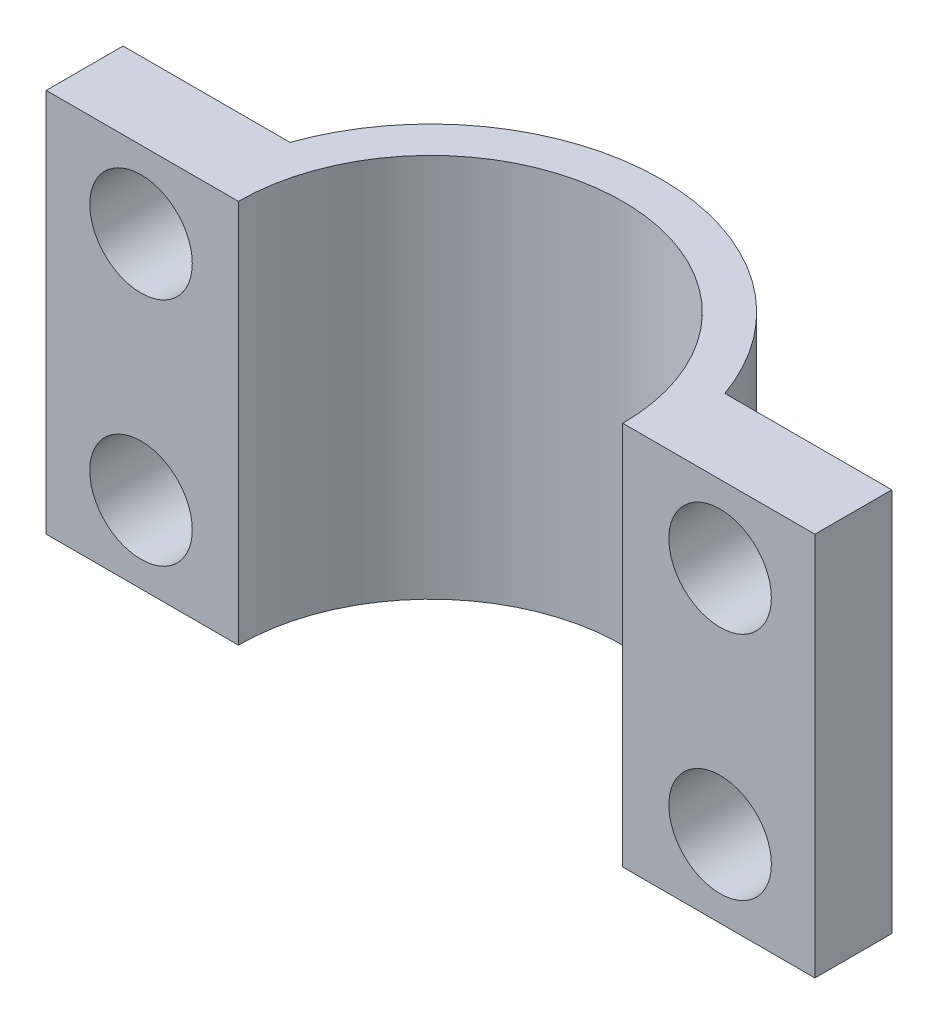
ISO-10303-21;
HEADER;
FILE_DESCRIPTION(('STEP AP214'),'2;1');
FILE_NAME('part.step','',(''),(''),'','','');
FILE_SCHEMA(('AUTOMOTIVE_DESIGN { 1 0 10303 214 1 1 1 1 }'));
ENDSEC;
DATA;
#1=APPLICATION_CONTEXT('core data for automotive mechanical design processes');
#2=APPLICATION_PROTOCOL_DEFINITION('international standard','automotive_design',2000,#1);
#3=PRODUCT_CONTEXT('',#1,'mechanical');
#4=PRODUCT('Part','Part','',(#3));
#5=PRODUCT_RELATED_PRODUCT_CATEGORY('part','',(#4));
#6=PRODUCT_DEFINITION_FORMATION('','',#4);
#7=PRODUCT_DEFINITION_CONTEXT('part definition',#1,'design');
#8=PRODUCT_DEFINITION('design','',#6,#7);
#9=PRODUCT_DEFINITION_SHAPE('','',#8);
#10=(LENGTH_UNIT() NAMED_UNIT(*) SI_UNIT(.MILLI.,.METRE.));
#11=(NAMED_UNIT(*) PLANE_ANGLE_UNIT() SI_UNIT($,.RADIAN.));
#12=(NAMED_UNIT(*) SI_UNIT($,.STERADIAN.) SOLID_ANGLE_UNIT());
#13=UNCERTAINTY_MEASURE_WITH_UNIT(LENGTH_MEASURE(1.E-05),#10,'distance_accuracy_value','');
#14=(GEOMETRIC_REPRESENTATION_CONTEXT(3) GLOBAL_UNCERTAINTY_ASSIGNED_CONTEXT((#13)) GLOBAL_UNIT_ASSIGNED_CONTEXT((#10,
#11,#12)) REPRESENTATION_CONTEXT('',''));
#15=CARTESIAN_POINT('',(0.,0.,0.));
#16=DIRECTION('',(0.,0.,1.));
#17=DIRECTION('',(1.,0.,0.));
#18=AXIS2_PLACEMENT_3D('',#15,#16,#17);
#19=CARTESIAN_POINT('',(0.,0.,15.));
#20=DIRECTION('',(0.,0.,1.));
#21=DIRECTION('',(1.,0.,0.));
#22=AXIS2_PLACEMENT_3D('',#19,#20,#21);
#23=PLANE('',#22);
#24=CARTESIAN_POINT('',(-11.3,4.5,15.));
#25=DIRECTION('',(0.,0.,1.));
#26=DIRECTION('',(1.,0.,0.));
#27=AXIS2_PLACEMENT_3D('',#24,#25,#26);
#28=CIRCLE('',#27,2.);
#29=CARTESIAN_POINT('',(-9.3,4.5,15.));
#30=VERTEX_POINT('',#29);
#31=EDGE_CURVE('E221',#30,#30,#28,.F.);
#32=ORIENTED_EDGE('',*,*,#31,.T.);
#33=EDGE_LOOP('',(#32));
#34=FACE_BOUND('',#33,.T.);
#35=CARTESIAN_POINT('',(-11.3,-4.5,15.));
#36=DIRECTION('',(0.,0.,1.));
#37=DIRECTION('',(1.,0.,0.));
#38=AXIS2_PLACEMENT_3D('',#35,#36,#37);
#39=CIRCLE('',#38,2.);
#40=CARTESIAN_POINT('',(-9.3,-4.5,15.));
#41=VERTEX_POINT('',#40);
#42=EDGE_CURVE('E197',#41,#41,#39,.F.);
#43=ORIENTED_EDGE('',*,*,#42,.T.);
#44=EDGE_LOOP('',(#43));
#45=FACE_BOUND('',#44,.T.);
#46=DIRECTION('',(0.,-1.,0.));
#47=VECTOR('',#46,1.);
#48=CARTESIAN_POINT('',(-7.5,7.5,15.));
#49=LINE('',#48,#47);
#50=CARTESIAN_POINT('',(-7.5,7.5,15.));
#51=VERTEX_POINT('',#50);
#52=CARTESIAN_POINT('',(-7.5,-7.5,15.));
#53=VERTEX_POINT('',#52);
#54=EDGE_CURVE('E11',#51,#53,#49,.T.);
#55=ORIENTED_EDGE('',*,*,#54,.F.);
#56=DIRECTION('',(-1.,0.,0.));
#57=VECTOR('',#56,1.);
#58=CARTESIAN_POINT('',(15.,7.5,15.));
#59=LINE('',#58,#57);
#60=CARTESIAN_POINT('',(-15.,7.5,15.));
#61=VERTEX_POINT('',#60);
#62=EDGE_CURVE('E152',#51,#61,#59,.T.);
#63=ORIENTED_EDGE('',*,*,#62,.T.);
#64=DIRECTION('',(0.,-1.,0.));
#65=VECTOR('',#64,1.);
#66=CARTESIAN_POINT('',(-15.,-7.5,15.));
#67=LINE('',#66,#65);
#68=CARTESIAN_POINT('',(-15.,-7.5,15.));
#69=VERTEX_POINT('',#68);
#70=EDGE_CURVE('E154',#61,#69,#67,.T.);
#71=ORIENTED_EDGE('',*,*,#70,.T.);
#72=DIRECTION('',(1.,0.,0.));
#73=VECTOR('',#72,1.);
#74=CARTESIAN_POINT('',(15.,-7.5,15.));
#75=LINE('',#74,#73);
#76=EDGE_CURVE('E163',#69,#53,#75,.T.);
#77=ORIENTED_EDGE('',*,*,#76,.T.);
#78=EDGE_LOOP('',(#55,#63,#71,#77));
#79=FACE_BOUND('',#78,.T.);
#80=ADVANCED_FACE('F39',(#34,#45,#79),#23,.T.);
#81=CARTESIAN_POINT('',(-15.,-7.5,15.));
#82=DIRECTION('',(1.,0.,0.));
#83=DIRECTION('',(0.,0.,-1.));
#84=AXIS2_PLACEMENT_3D('',#81,#82,#83);
#85=PLANE('',#84);
#86=DIRECTION('',(0.,0.,-1.));
#87=VECTOR('',#86,1.);
#88=CARTESIAN_POINT('',(-15.,7.5,15.));
#89=LINE('',#88,#87);
#90=CARTESIAN_POINT('',(-15.,7.5,12.));
#91=VERTEX_POINT('',#90);
#92=EDGE_CURVE('E132',#61,#91,#89,.T.);
#93=ORIENTED_EDGE('',*,*,#92,.T.);
#94=DIRECTION('',(0.,-1.,0.));
#95=VECTOR('',#94,1.);
#96=CARTESIAN_POINT('',(-15.,7.5,12.));
#97=LINE('',#96,#95);
#98=CARTESIAN_POINT('',(-15.,-7.5,12.));
#99=VERTEX_POINT('',#98);
#100=EDGE_CURVE('E172',#91,#99,#97,.T.);
#101=ORIENTED_EDGE('',*,*,#100,.T.);
#102=DIRECTION('',(0.,0.,-1.));
#103=VECTOR('',#102,1.);
#104=CARTESIAN_POINT('',(-15.,-7.5,15.));
#105=LINE('',#104,#103);
#106=EDGE_CURVE('E136',#69,#99,#105,.T.);
#107=ORIENTED_EDGE('',*,*,#106,.F.);
#108=ORIENTED_EDGE('',*,*,#70,.F.);
#109=EDGE_LOOP('',(#93,#101,#107,#108));
#110=FACE_BOUND('',#109,.T.);
#111=ADVANCED_FACE('F41',(#110),#85,.F.);
#112=CARTESIAN_POINT('',(15.,-7.5,15.));
#113=DIRECTION('',(0.,1.,0.));
#114=DIRECTION('',(-1.,0.,0.));
#115=AXIS2_PLACEMENT_3D('',#112,#113,#114);
#116=PLANE('',#115);
#117=ORIENTED_EDGE('',*,*,#106,.T.);
#118=DIRECTION('',(-1.,0.,0.));
#119=VECTOR('',#118,1.);
#120=CARTESIAN_POINT('',(-15.,-7.5,12.));
#121=LINE('',#120,#119);
#122=CARTESIAN_POINT('',(-8.48528137423857,-7.5,12.));
#123=VERTEX_POINT('',#122);
#124=EDGE_CURVE('E113',#123,#99,#121,.T.);
#125=ORIENTED_EDGE('',*,*,#124,.F.);
#126=CARTESIAN_POINT('',(0.,-7.5,15.));
#127=DIRECTION('',(0.,1.,0.));
#128=DIRECTION('',(1.,0.,0.));
#129=AXIS2_PLACEMENT_3D('',#126,#127,#128);
#130=CIRCLE('',#129,9.);
#131=CARTESIAN_POINT('',(8.48528137423857,-7.5,12.));
#132=VERTEX_POINT('',#131);
#133=EDGE_CURVE('E184',#132,#123,#130,.T.);
#134=ORIENTED_EDGE('',*,*,#133,.F.);
#135=DIRECTION('',(-1.,0.,0.));
#136=VECTOR('',#135,1.);
#137=CARTESIAN_POINT('',(8.48528137423857,-7.5,12.));
#138=LINE('',#137,#136);
#139=CARTESIAN_POINT('',(15.,-7.5,12.));
#140=VERTEX_POINT('',#139);
#141=EDGE_CURVE('E188',#140,#132,#138,.T.);
#142=ORIENTED_EDGE('',*,*,#141,.F.);
#143=DIRECTION('',(0.,0.,-1.));
#144=VECTOR('',#143,1.);
#145=CARTESIAN_POINT('',(15.,-7.5,15.));
#146=LINE('',#145,#144);
#147=CARTESIAN_POINT('',(15.,-7.5,15.));
#148=VERTEX_POINT('',#147);
#149=EDGE_CURVE('E123',#148,#140,#146,.T.);
#150=ORIENTED_EDGE('',*,*,#149,.F.);
#151=CARTESIAN_POINT('',(7.5,-7.5,15.));
#152=VERTEX_POINT('',#151);
#153=EDGE_CURVE('E167',#152,#148,#75,.T.);
#154=ORIENTED_EDGE('',*,*,#153,.F.);
#155=CARTESIAN_POINT('',(0.,-7.5,15.));
#156=DIRECTION('',(0.,-1.,0.));
#157=DIRECTION('',(1.,0.,0.));
#158=AXIS2_PLACEMENT_3D('',#155,#156,#157);
#159=CIRCLE('',#158,7.5);
#160=EDGE_CURVE('E62',#53,#152,#159,.T.);
#161=ORIENTED_EDGE('',*,*,#160,.F.);
#162=ORIENTED_EDGE('',*,*,#76,.F.);
#163=EDGE_LOOP('',(#117,#125,#134,#142,#150,#154,#161,#162));
#164=FACE_BOUND('',#163,.T.);
#165=ADVANCED_FACE('F245',(#164),#116,.F.);
#166=CARTESIAN_POINT('',(15.,-7.5,15.));
#167=DIRECTION('',(-1.,0.,0.));
#168=DIRECTION('',(0.,0.,1.));
#169=AXIS2_PLACEMENT_3D('',#166,#167,#168);
#170=PLANE('',#169);
#171=ORIENTED_EDGE('',*,*,#149,.T.);
#172=DIRECTION('',(0.,-1.,0.));
#173=VECTOR('',#172,1.);
#174=CARTESIAN_POINT('',(15.,7.5,12.));
#175=LINE('',#174,#173);
#176=CARTESIAN_POINT('',(15.,7.5,12.));
#177=VERTEX_POINT('',#176);
#178=EDGE_CURVE('E107',#177,#140,#175,.T.);
#179=ORIENTED_EDGE('',*,*,#178,.F.);
#180=DIRECTION('',(0.,0.,-1.));
#181=VECTOR('',#180,1.);
#182=CARTESIAN_POINT('',(15.,7.5,15.));
#183=LINE('',#182,#181);
#184=CARTESIAN_POINT('',(15.,7.5,15.));
#185=VERTEX_POINT('',#184);
#186=EDGE_CURVE('E120',#185,#177,#183,.T.);
#187=ORIENTED_EDGE('',*,*,#186,.F.);
#188=DIRECTION('',(0.,1.,0.));
#189=VECTOR('',#188,1.);
#190=CARTESIAN_POINT('',(15.,-7.5,15.));
#191=LINE('',#190,#189);
#192=EDGE_CURVE('E157',#148,#185,#191,.T.);
#193=ORIENTED_EDGE('',*,*,#192,.F.);
#194=EDGE_LOOP('',(#171,#179,#187,#193));
#195=FACE_BOUND('',#194,.T.);
#196=ADVANCED_FACE('F118',(#195),#170,.F.);
#197=CARTESIAN_POINT('',(15.,7.5,15.));
#198=DIRECTION('',(0.,-1.,0.));
#199=DIRECTION('',(1.,0.,0.));
#200=AXIS2_PLACEMENT_3D('',#197,#198,#199);
#201=PLANE('',#200);
#202=CARTESIAN_POINT('',(0.,7.5,15.));
#203=DIRECTION('',(0.,1.,0.));
#204=DIRECTION('',(1.,0.,0.));
#205=AXIS2_PLACEMENT_3D('',#202,#203,#204);
#206=CIRCLE('',#205,9.);
#207=CARTESIAN_POINT('',(8.48528137423857,7.5,12.));
#208=VERTEX_POINT('',#207);
#209=CARTESIAN_POINT('',(-8.48528137423857,7.5,12.));
#210=VERTEX_POINT('',#209);
#211=EDGE_CURVE('E55',#208,#210,#206,.T.);
#212=ORIENTED_EDGE('',*,*,#211,.T.);
#213=DIRECTION('',(-1.,0.,0.));
#214=VECTOR('',#213,1.);
#215=CARTESIAN_POINT('',(-9.,7.5,12.));
#216=LINE('',#215,#214);
#217=EDGE_CURVE('E125',#210,#91,#216,.T.);
#218=ORIENTED_EDGE('',*,*,#217,.T.);
#219=ORIENTED_EDGE('',*,*,#92,.F.);
#220=ORIENTED_EDGE('',*,*,#62,.F.);
#221=CARTESIAN_POINT('',(0.,7.5,15.));
#222=DIRECTION('',(0.,-1.,0.));
#223=DIRECTION('',(1.,0.,0.));
#224=AXIS2_PLACEMENT_3D('',#221,#222,#223);
#225=CIRCLE('',#224,7.5);
#226=CARTESIAN_POINT('',(7.5,7.5,15.));
#227=VERTEX_POINT('',#226);
#228=EDGE_CURVE('E146',#51,#227,#225,.T.);
#229=ORIENTED_EDGE('',*,*,#228,.T.);
#230=EDGE_CURVE('E130',#185,#227,#59,.T.);
#231=ORIENTED_EDGE('',*,*,#230,.F.);
#232=ORIENTED_EDGE('',*,*,#186,.T.);
#233=DIRECTION('',(-1.,0.,0.));
#234=VECTOR('',#233,1.);
#235=CARTESIAN_POINT('',(15.,7.5,12.));
#236=LINE('',#235,#234);
#237=EDGE_CURVE('E103',#177,#208,#236,.T.);
#238=ORIENTED_EDGE('',*,*,#237,.T.);
#239=EDGE_LOOP('',(#212,#218,#219,#220,#229,#231,#232,#238));
#240=FACE_BOUND('',#239,.T.);
#241=ADVANCED_FACE('F127',(#240),#201,.F.);
#242=CARTESIAN_POINT('',(11.3,-4.5,15.));
#243=DIRECTION('',(0.,0.,1.));
#244=DIRECTION('',(1.,0.,0.));
#245=AXIS2_PLACEMENT_3D('',#242,#243,#244);
#246=CIRCLE('',#245,2.);
#247=CARTESIAN_POINT('',(13.3,-4.5,15.));
#248=VERTEX_POINT('',#247);
#249=EDGE_CURVE('E205',#248,#248,#246,.F.);
#250=ORIENTED_EDGE('',*,*,#249,.T.);
#251=EDGE_LOOP('',(#250));
#252=FACE_BOUND('',#251,.T.);
#253=CARTESIAN_POINT('',(11.3,4.5,15.));
#254=DIRECTION('',(0.,0.,1.));
#255=DIRECTION('',(1.,0.,0.));
#256=AXIS2_PLACEMENT_3D('',#253,#254,#255);
#257=CIRCLE('',#256,2.);
#258=CARTESIAN_POINT('',(13.3,4.5,15.));
#259=VERTEX_POINT('',#258);
#260=EDGE_CURVE('E213',#259,#259,#257,.F.);
#261=ORIENTED_EDGE('',*,*,#260,.T.);
#262=EDGE_LOOP('',(#261));
#263=FACE_BOUND('',#262,.T.);
#264=DIRECTION('',(0.,-1.,0.));
#265=VECTOR('',#264,1.);
#266=CARTESIAN_POINT('',(7.5,7.5,15.));
#267=LINE('',#266,#265);
#268=EDGE_CURVE('E48',#152,#227,#267,.F.);
#269=ORIENTED_EDGE('',*,*,#268,.F.);
#270=ORIENTED_EDGE('',*,*,#153,.T.);
#271=ORIENTED_EDGE('',*,*,#192,.T.);
#272=ORIENTED_EDGE('',*,*,#230,.T.);
#273=EDGE_LOOP('',(#269,#270,#271,#272));
#274=FACE_BOUND('',#273,.T.);
#275=ADVANCED_FACE('F156',(#252,#263,#274),#23,.T.);
#276=CARTESIAN_POINT('',(0.,7.5,15.));
#277=DIRECTION('',(0.,-1.,0.));
#278=DIRECTION('',(1.,0.,0.));
#279=AXIS2_PLACEMENT_3D('',#276,#277,#278);
#280=CYLINDRICAL_SURFACE('',#279,7.5);
#281=ORIENTED_EDGE('',*,*,#54,.T.);
#282=ORIENTED_EDGE('',*,*,#160,.T.);
#283=ORIENTED_EDGE('',*,*,#268,.T.);
#284=ORIENTED_EDGE('',*,*,#228,.F.);
#285=EDGE_LOOP('',(#281,#282,#283,#284));
#286=FACE_BOUND('',#285,.T.);
#287=ADVANCED_FACE('F145',(#286),#280,.F.);
#288=CARTESIAN_POINT('',(-15.,7.5,12.));
#289=DIRECTION('',(0.,0.,1.));
#290=DIRECTION('',(1.,0.,0.));
#291=AXIS2_PLACEMENT_3D('',#288,#289,#290);
#292=PLANE('',#291);
#293=CARTESIAN_POINT('',(-11.3,4.5,12.));
#294=DIRECTION('',(0.,0.,-1.));
#295=DIRECTION('',(-1.,0.,0.));
#296=AXIS2_PLACEMENT_3D('',#293,#294,#295);
#297=CIRCLE('',#296,2.);
#298=CARTESIAN_POINT('',(-13.3,4.5,12.));
#299=VERTEX_POINT('',#298);
#300=EDGE_CURVE('E201',#299,#299,#297,.T.);
#301=ORIENTED_EDGE('',*,*,#300,.F.);
#302=EDGE_LOOP('',(#301));
#303=FACE_BOUND('',#302,.T.);
#304=CARTESIAN_POINT('',(-11.3,-4.5,12.));
#305=DIRECTION('',(0.,0.,-1.));
#306=DIRECTION('',(-1.,0.,0.));
#307=AXIS2_PLACEMENT_3D('',#304,#305,#306);
#308=CIRCLE('',#307,2.);
#309=CARTESIAN_POINT('',(-13.3,-4.5,12.));
#310=VERTEX_POINT('',#309);
#311=EDGE_CURVE('E191',#310,#310,#308,.T.);
#312=ORIENTED_EDGE('',*,*,#311,.F.);
#313=EDGE_LOOP('',(#312));
#314=FACE_BOUND('',#313,.T.);
#315=ORIENTED_EDGE('',*,*,#124,.T.);
#316=ORIENTED_EDGE('',*,*,#100,.F.);
#317=ORIENTED_EDGE('',*,*,#217,.F.);
#318=DIRECTION('',(0.,-1.,0.));
#319=VECTOR('',#318,1.);
#320=CARTESIAN_POINT('',(-8.48528137423857,7.5,12.));
#321=LINE('',#320,#319);
#322=EDGE_CURVE('E176',#210,#123,#321,.T.);
#323=ORIENTED_EDGE('',*,*,#322,.T.);
#324=EDGE_LOOP('',(#315,#316,#317,#323));
#325=FACE_BOUND('',#324,.T.);
#326=ADVANCED_FACE('F231',(#303,#314,#325),#292,.F.);
#327=CARTESIAN_POINT('',(0.,7.5,15.));
#328=DIRECTION('',(0.,-1.,0.));
#329=DIRECTION('',(1.,0.,0.));
#330=AXIS2_PLACEMENT_3D('',#327,#328,#329);
#331=CYLINDRICAL_SURFACE('',#330,9.);
#332=ORIENTED_EDGE('',*,*,#133,.T.);
#333=ORIENTED_EDGE('',*,*,#322,.F.);
#334=ORIENTED_EDGE('',*,*,#211,.F.);
#335=DIRECTION('',(0.,-1.,0.));
#336=VECTOR('',#335,1.);
#337=CARTESIAN_POINT('',(8.48528137423857,7.5,12.));
#338=LINE('',#337,#336);
#339=EDGE_CURVE('E109',#208,#132,#338,.T.);
#340=ORIENTED_EDGE('',*,*,#339,.T.);
#341=EDGE_LOOP('',(#332,#333,#334,#340));
#342=FACE_BOUND('',#341,.T.);
#343=ADVANCED_FACE('F234',(#342),#331,.T.);
#344=CARTESIAN_POINT('',(8.48528137423857,7.5,12.));
#345=DIRECTION('',(0.,0.,1.));
#346=DIRECTION('',(1.,0.,0.));
#347=AXIS2_PLACEMENT_3D('',#344,#345,#346);
#348=PLANE('',#347);
#349=CARTESIAN_POINT('',(11.3,-4.5,12.));
#350=DIRECTION('',(0.,0.,-1.));
#351=DIRECTION('',(1.,0.,0.));
#352=AXIS2_PLACEMENT_3D('',#349,#350,#351);
#353=CIRCLE('',#352,2.);
#354=CARTESIAN_POINT('',(13.3,-4.5,12.));
#355=VERTEX_POINT('',#354);
#356=EDGE_CURVE('E209',#355,#355,#353,.T.);
#357=ORIENTED_EDGE('',*,*,#356,.F.);
#358=EDGE_LOOP('',(#357));
#359=FACE_BOUND('',#358,.T.);
#360=CARTESIAN_POINT('',(11.3,4.5,12.));
#361=DIRECTION('',(0.,0.,-1.));
#362=DIRECTION('',(1.,0.,0.));
#363=AXIS2_PLACEMENT_3D('',#360,#361,#362);
#364=CIRCLE('',#363,2.);
#365=CARTESIAN_POINT('',(13.3,4.5,12.));
#366=VERTEX_POINT('',#365);
#367=EDGE_CURVE('E217',#366,#366,#364,.T.);
#368=ORIENTED_EDGE('',*,*,#367,.F.);
#369=EDGE_LOOP('',(#368));
#370=FACE_BOUND('',#369,.T.);
#371=ORIENTED_EDGE('',*,*,#141,.T.);
#372=ORIENTED_EDGE('',*,*,#339,.F.);
#373=ORIENTED_EDGE('',*,*,#237,.F.);
#374=ORIENTED_EDGE('',*,*,#178,.T.);
#375=EDGE_LOOP('',(#371,#372,#373,#374));
#376=FACE_BOUND('',#375,.T.);
#377=ADVANCED_FACE('F106',(#359,#370,#376),#348,.F.);
#378=CARTESIAN_POINT('',(11.3,4.5,15.001));
#379=DIRECTION('',(0.,0.,-1.));
#380=DIRECTION('',(-1.,0.,0.));
#381=AXIS2_PLACEMENT_3D('',#378,#379,#380);
#382=CYLINDRICAL_SURFACE('',#381,2.);
#383=ORIENTED_EDGE('',*,*,#260,.F.);
#384=EDGE_LOOP('',(#383));
#385=FACE_BOUND('',#384,.T.);
#386=ORIENTED_EDGE('',*,*,#367,.T.);
#387=EDGE_LOOP('',(#386));
#388=FACE_BOUND('',#387,.T.);
#389=ADVANCED_FACE('F266',(#385,#388),#382,.F.);
#390=CARTESIAN_POINT('',(11.3,-4.5,15.001));
#391=DIRECTION('',(0.,0.,-1.));
#392=DIRECTION('',(-1.,0.,0.));
#393=AXIS2_PLACEMENT_3D('',#390,#391,#392);
#394=CYLINDRICAL_SURFACE('',#393,2.);
#395=ORIENTED_EDGE('',*,*,#249,.F.);
#396=EDGE_LOOP('',(#395));
#397=FACE_BOUND('',#396,.T.);
#398=ORIENTED_EDGE('',*,*,#356,.T.);
#399=EDGE_LOOP('',(#398));
#400=FACE_BOUND('',#399,.T.);
#401=ADVANCED_FACE('F269',(#397,#400),#394,.F.);
#402=CARTESIAN_POINT('',(-11.3,-4.5,15.001));
#403=DIRECTION('',(0.,0.,-1.));
#404=DIRECTION('',(-1.,0.,0.));
#405=AXIS2_PLACEMENT_3D('',#402,#403,#404);
#406=CYLINDRICAL_SURFACE('',#405,2.);
#407=ORIENTED_EDGE('',*,*,#42,.F.);
#408=EDGE_LOOP('',(#407));
#409=FACE_BOUND('',#408,.T.);
#410=ORIENTED_EDGE('',*,*,#311,.T.);
#411=EDGE_LOOP('',(#410));
#412=FACE_BOUND('',#411,.T.);
#413=ADVANCED_FACE('F282',(#409,#412),#406,.F.);
#414=CARTESIAN_POINT('',(-11.3,4.5,15.001));
#415=DIRECTION('',(0.,0.,-1.));
#416=DIRECTION('',(-1.,0.,0.));
#417=AXIS2_PLACEMENT_3D('',#414,#415,#416);
#418=CYLINDRICAL_SURFACE('',#417,2.);
#419=ORIENTED_EDGE('',*,*,#31,.F.);
#420=EDGE_LOOP('',(#419));
#421=FACE_BOUND('',#420,.T.);
#422=ORIENTED_EDGE('',*,*,#300,.T.);
#423=EDGE_LOOP('',(#422));
#424=FACE_BOUND('',#423,.T.);
#425=ADVANCED_FACE('F229',(#421,#424),#418,.F.);
#426=CLOSED_SHELL('',(#80,#111,#165,#196,#241,#275,#287,#326,#343,#377,#389,#401,#413,#425));
#427=MANIFOLD_SOLID_BREP('B2',#426);
#428=ADVANCED_BREP_SHAPE_REPRESENTATION('',(#18,#427),#14);
#429=SHAPE_DEFINITION_REPRESENTATION(#9,#428);
ENDSEC;
END-ISO-10303-21;
